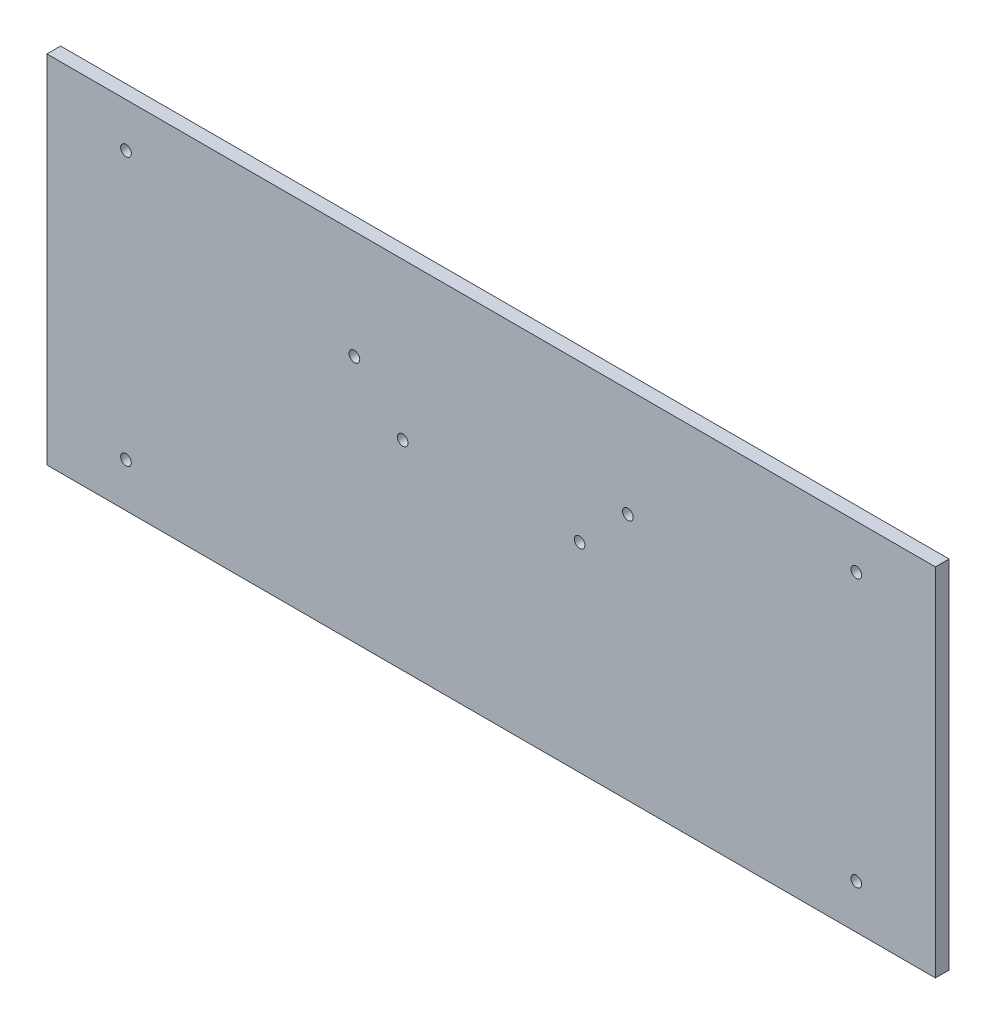
ISO-10303-21;
HEADER;
FILE_DESCRIPTION(('STEP AP214'),'2;1');
FILE_NAME('part.step','',(''),(''),'','','');
FILE_SCHEMA(('AUTOMOTIVE_DESIGN { 1 0 10303 214 1 1 1 1 }'));
ENDSEC;
DATA;
#1=APPLICATION_CONTEXT('core data for automotive mechanical design processes');
#2=APPLICATION_PROTOCOL_DEFINITION('international standard','automotive_design',2000,#1);
#3=PRODUCT_CONTEXT('',#1,'mechanical');
#4=PRODUCT('Part','Part','',(#3));
#5=PRODUCT_RELATED_PRODUCT_CATEGORY('part','',(#4));
#6=PRODUCT_DEFINITION_FORMATION('','',#4);
#7=PRODUCT_DEFINITION_CONTEXT('part definition',#1,'design');
#8=PRODUCT_DEFINITION('design','',#6,#7);
#9=PRODUCT_DEFINITION_SHAPE('','',#8);
#10=(LENGTH_UNIT() NAMED_UNIT(*) SI_UNIT(.MILLI.,.METRE.));
#11=(NAMED_UNIT(*) PLANE_ANGLE_UNIT() SI_UNIT($,.RADIAN.));
#12=(NAMED_UNIT(*) SI_UNIT($,.STERADIAN.) SOLID_ANGLE_UNIT());
#13=UNCERTAINTY_MEASURE_WITH_UNIT(LENGTH_MEASURE(1.E-05),#10,'distance_accuracy_value','');
#14=(GEOMETRIC_REPRESENTATION_CONTEXT(3) GLOBAL_UNCERTAINTY_ASSIGNED_CONTEXT((#13)) GLOBAL_UNIT_ASSIGNED_CONTEXT((#10,
#11,#12)) REPRESENTATION_CONTEXT('',''));
#15=CARTESIAN_POINT('',(0.,0.,0.));
#16=DIRECTION('',(0.,0.,1.));
#17=DIRECTION('',(1.,0.,0.));
#18=AXIS2_PLACEMENT_3D('',#15,#16,#17);
#19=CARTESIAN_POINT('',(-146.,0.,4.5));
#20=DIRECTION('',(-1.,0.,0.));
#21=DIRECTION('',(0.,0.,1.));
#22=AXIS2_PLACEMENT_3D('',#19,#20,#21);
#23=PLANE('',#22);
#24=DIRECTION('',(0.,1.,0.));
#25=VECTOR('',#24,1.);
#26=CARTESIAN_POINT('',(-146.,0.,0.));
#27=LINE('',#26,#25);
#28=CARTESIAN_POINT('',(-146.,-58.5,0.));
#29=VERTEX_POINT('',#28);
#30=CARTESIAN_POINT('',(-146.,58.5,0.));
#31=VERTEX_POINT('',#30);
#32=EDGE_CURVE('E108',#29,#31,#27,.T.);
#33=ORIENTED_EDGE('',*,*,#32,.F.);
#34=DIRECTION('',(0.,0.,-1.));
#35=VECTOR('',#34,1.);
#36=CARTESIAN_POINT('',(-146.,-58.5,4.5));
#37=LINE('',#36,#35);
#38=CARTESIAN_POINT('',(-146.,-58.5,4.5));
#39=VERTEX_POINT('',#38);
#40=EDGE_CURVE('E11',#39,#29,#37,.T.);
#41=ORIENTED_EDGE('',*,*,#40,.F.);
#42=DIRECTION('',(0.,1.,0.));
#43=VECTOR('',#42,1.);
#44=CARTESIAN_POINT('',(-146.,0.,4.5));
#45=LINE('',#44,#43);
#46=CARTESIAN_POINT('',(-146.,58.5,4.5));
#47=VERTEX_POINT('',#46);
#48=EDGE_CURVE('E98',#39,#47,#45,.T.);
#49=ORIENTED_EDGE('',*,*,#48,.T.);
#50=DIRECTION('',(0.,0.,-1.));
#51=VECTOR('',#50,1.);
#52=CARTESIAN_POINT('',(-146.,58.5,4.5));
#53=LINE('',#52,#51);
#54=EDGE_CURVE('E77',#47,#31,#53,.T.);
#55=ORIENTED_EDGE('',*,*,#54,.T.);
#56=EDGE_LOOP('',(#33,#41,#49,#55));
#57=FACE_BOUND('',#56,.T.);
#58=ADVANCED_FACE('F38',(#57),#23,.T.);
#59=CARTESIAN_POINT('',(0.,-58.5,4.5));
#60=DIRECTION('',(0.,-1.,0.));
#61=DIRECTION('',(1.,0.,0.));
#62=AXIS2_PLACEMENT_3D('',#59,#60,#61);
#63=PLANE('',#62);
#64=DIRECTION('',(-1.,0.,0.));
#65=VECTOR('',#64,1.);
#66=CARTESIAN_POINT('',(0.,-58.5,0.));
#67=LINE('',#66,#65);
#68=CARTESIAN_POINT('',(146.,-58.5,0.));
#69=VERTEX_POINT('',#68);
#70=EDGE_CURVE('E90',#69,#29,#67,.T.);
#71=ORIENTED_EDGE('',*,*,#70,.F.);
#72=DIRECTION('',(0.,0.,-1.));
#73=VECTOR('',#72,1.);
#74=CARTESIAN_POINT('',(146.,-58.5,4.5));
#75=LINE('',#74,#73);
#76=CARTESIAN_POINT('',(146.,-58.5,4.5));
#77=VERTEX_POINT('',#76);
#78=EDGE_CURVE('E47',#77,#69,#75,.T.);
#79=ORIENTED_EDGE('',*,*,#78,.F.);
#80=DIRECTION('',(-1.,0.,0.));
#81=VECTOR('',#80,1.);
#82=CARTESIAN_POINT('',(0.,-58.5,4.5));
#83=LINE('',#82,#81);
#84=EDGE_CURVE('E88',#77,#39,#83,.T.);
#85=ORIENTED_EDGE('',*,*,#84,.T.);
#86=ORIENTED_EDGE('',*,*,#40,.T.);
#87=EDGE_LOOP('',(#71,#79,#85,#86));
#88=FACE_BOUND('',#87,.T.);
#89=ADVANCED_FACE('F86',(#88),#63,.T.);
#90=CARTESIAN_POINT('',(146.,0.,4.5));
#91=DIRECTION('',(-1.,0.,0.));
#92=DIRECTION('',(0.,0.,1.));
#93=AXIS2_PLACEMENT_3D('',#90,#91,#92);
#94=PLANE('',#93);
#95=DIRECTION('',(0.,1.,0.));
#96=VECTOR('',#95,1.);
#97=CARTESIAN_POINT('',(146.,0.,0.));
#98=LINE('',#97,#96);
#99=CARTESIAN_POINT('',(146.,58.5,0.));
#100=VERTEX_POINT('',#99);
#101=EDGE_CURVE('E70',#69,#100,#98,.T.);
#102=ORIENTED_EDGE('',*,*,#101,.T.);
#103=DIRECTION('',(0.,0.,-1.));
#104=VECTOR('',#103,1.);
#105=CARTESIAN_POINT('',(146.,58.5,4.5));
#106=LINE('',#105,#104);
#107=CARTESIAN_POINT('',(146.,58.5,4.5));
#108=VERTEX_POINT('',#107);
#109=EDGE_CURVE('E92',#108,#100,#106,.T.);
#110=ORIENTED_EDGE('',*,*,#109,.F.);
#111=DIRECTION('',(0.,1.,0.));
#112=VECTOR('',#111,1.);
#113=CARTESIAN_POINT('',(146.,0.,4.5));
#114=LINE('',#113,#112);
#115=EDGE_CURVE('E93',#77,#108,#114,.T.);
#116=ORIENTED_EDGE('',*,*,#115,.F.);
#117=ORIENTED_EDGE('',*,*,#78,.T.);
#118=EDGE_LOOP('',(#102,#110,#116,#117));
#119=FACE_BOUND('',#118,.T.);
#120=ADVANCED_FACE('F94',(#119),#94,.F.);
#121=CARTESIAN_POINT('',(0.,58.5,4.5));
#122=DIRECTION('',(0.,-1.,0.));
#123=DIRECTION('',(1.,0.,0.));
#124=AXIS2_PLACEMENT_3D('',#121,#122,#123);
#125=PLANE('',#124);
#126=DIRECTION('',(-1.,0.,0.));
#127=VECTOR('',#126,1.);
#128=CARTESIAN_POINT('',(0.,58.5,0.));
#129=LINE('',#128,#127);
#130=EDGE_CURVE('E102',#100,#31,#129,.T.);
#131=ORIENTED_EDGE('',*,*,#130,.T.);
#132=ORIENTED_EDGE('',*,*,#54,.F.);
#133=DIRECTION('',(-1.,0.,0.));
#134=VECTOR('',#133,1.);
#135=CARTESIAN_POINT('',(0.,58.5,4.5));
#136=LINE('',#135,#134);
#137=EDGE_CURVE('E55',#108,#47,#136,.T.);
#138=ORIENTED_EDGE('',*,*,#137,.F.);
#139=ORIENTED_EDGE('',*,*,#109,.T.);
#140=EDGE_LOOP('',(#131,#132,#138,#139));
#141=FACE_BOUND('',#140,.T.);
#142=ADVANCED_FACE('F124',(#141),#125,.F.);
#143=CARTESIAN_POINT('',(0.,0.,4.5));
#144=DIRECTION('',(0.,0.,1.));
#145=DIRECTION('',(1.,0.,0.));
#146=AXIS2_PLACEMENT_3D('',#143,#144,#145);
#147=PLANE('',#146);
#148=CARTESIAN_POINT('',(29.0710678118655,7.07106781186543,4.5));
#149=DIRECTION('',(0.,0.,1.));
#150=DIRECTION('',(-1.,0.,0.));
#151=AXIS2_PLACEMENT_3D('',#148,#149,#150);
#152=CIRCLE('',#151,1.75);
#153=CARTESIAN_POINT('',(27.3210678118655,7.07106781186543,4.5));
#154=VERTEX_POINT('',#153);
#155=EDGE_CURVE('E204',#154,#154,#152,.T.);
#156=ORIENTED_EDGE('',*,*,#155,.F.);
#157=EDGE_LOOP('',(#156));
#158=FACE_BOUND('',#157,.T.);
#159=CARTESIAN_POINT('',(44.9289321881345,22.9289321881344,4.5));
#160=DIRECTION('',(0.,0.,1.));
#161=DIRECTION('',(-1.,0.,0.));
#162=AXIS2_PLACEMENT_3D('',#159,#160,#161);
#163=CIRCLE('',#162,1.75);
#164=CARTESIAN_POINT('',(43.1789321881345,22.9289321881344,4.5));
#165=VERTEX_POINT('',#164);
#166=EDGE_CURVE('E196',#165,#165,#163,.T.);
#167=ORIENTED_EDGE('',*,*,#166,.F.);
#168=EDGE_LOOP('',(#167));
#169=FACE_BOUND('',#168,.T.);
#170=CARTESIAN_POINT('',(-44.9289321881344,22.9289321881345,4.5));
#171=DIRECTION('',(0.,0.,1.));
#172=DIRECTION('',(1.,0.,0.));
#173=AXIS2_PLACEMENT_3D('',#170,#171,#172);
#174=CIRCLE('',#173,1.75);
#175=CARTESIAN_POINT('',(-43.1789321881344,22.9289321881345,4.5));
#176=VERTEX_POINT('',#175);
#177=EDGE_CURVE('E180',#176,#176,#174,.T.);
#178=ORIENTED_EDGE('',*,*,#177,.F.);
#179=EDGE_LOOP('',(#178));
#180=FACE_BOUND('',#179,.T.);
#181=CARTESIAN_POINT('',(-29.0710678118655,7.07106781186548,4.5));
#182=DIRECTION('',(0.,0.,1.));
#183=DIRECTION('',(1.,0.,0.));
#184=AXIS2_PLACEMENT_3D('',#181,#182,#183);
#185=CIRCLE('',#184,1.75);
#186=CARTESIAN_POINT('',(-27.3210678118655,7.07106781186548,4.5));
#187=VERTEX_POINT('',#186);
#188=EDGE_CURVE('E186',#187,#187,#185,.T.);
#189=ORIENTED_EDGE('',*,*,#188,.F.);
#190=EDGE_LOOP('',(#189));
#191=FACE_BOUND('',#190,.T.);
#192=CARTESIAN_POINT('',(120.,44.,4.5));
#193=DIRECTION('',(0.,0.,1.));
#194=DIRECTION('',(1.,0.,0.));
#195=AXIS2_PLACEMENT_3D('',#192,#193,#194);
#196=CIRCLE('',#195,1.75);
#197=CARTESIAN_POINT('',(121.75,44.,4.5));
#198=VERTEX_POINT('',#197);
#199=EDGE_CURVE('E214',#198,#198,#196,.F.);
#200=ORIENTED_EDGE('',*,*,#199,.T.);
#201=EDGE_LOOP('',(#200));
#202=FACE_BOUND('',#201,.T.);
#203=CARTESIAN_POINT('',(120.,-44.,4.5));
#204=DIRECTION('',(0.,0.,1.));
#205=DIRECTION('',(1.,0.,0.));
#206=AXIS2_PLACEMENT_3D('',#203,#204,#205);
#207=CIRCLE('',#206,1.75);
#208=CARTESIAN_POINT('',(121.75,-44.,4.5));
#209=VERTEX_POINT('',#208);
#210=EDGE_CURVE('E226',#209,#209,#207,.T.);
#211=ORIENTED_EDGE('',*,*,#210,.F.);
#212=EDGE_LOOP('',(#211));
#213=FACE_BOUND('',#212,.T.);
#214=CARTESIAN_POINT('',(-120.,-44.,4.5));
#215=DIRECTION('',(0.,0.,1.));
#216=DIRECTION('',(1.,0.,0.));
#217=AXIS2_PLACEMENT_3D('',#214,#215,#216);
#218=CIRCLE('',#217,1.75);
#219=CARTESIAN_POINT('',(-118.25,-44.,4.5));
#220=VERTEX_POINT('',#219);
#221=EDGE_CURVE('E230',#220,#220,#218,.F.);
#222=ORIENTED_EDGE('',*,*,#221,.T.);
#223=EDGE_LOOP('',(#222));
#224=FACE_BOUND('',#223,.T.);
#225=CARTESIAN_POINT('',(-120.,44.,4.5));
#226=DIRECTION('',(0.,0.,1.));
#227=DIRECTION('',(1.,0.,0.));
#228=AXIS2_PLACEMENT_3D('',#225,#226,#227);
#229=CIRCLE('',#228,1.75);
#230=CARTESIAN_POINT('',(-118.25,44.,4.5));
#231=VERTEX_POINT('',#230);
#232=EDGE_CURVE('E112',#231,#231,#229,.T.);
#233=ORIENTED_EDGE('',*,*,#232,.F.);
#234=EDGE_LOOP('',(#233));
#235=FACE_BOUND('',#234,.T.);
#236=ORIENTED_EDGE('',*,*,#48,.F.);
#237=ORIENTED_EDGE('',*,*,#84,.F.);
#238=ORIENTED_EDGE('',*,*,#115,.T.);
#239=ORIENTED_EDGE('',*,*,#137,.T.);
#240=EDGE_LOOP('',(#236,#237,#238,#239));
#241=FACE_BOUND('',#240,.T.);
#242=ADVANCED_FACE('F97',(#158,#169,#180,#191,#202,#213,#224,#235,#241),#147,.T.);
#243=CARTESIAN_POINT('',(0.,0.,0.));
#244=DIRECTION('',(0.,0.,1.));
#245=DIRECTION('',(1.,0.,0.));
#246=AXIS2_PLACEMENT_3D('',#243,#244,#245);
#247=PLANE('',#246);
#248=CARTESIAN_POINT('',(29.0710678118655,7.07106781186543,0.));
#249=DIRECTION('',(0.,0.,1.));
#250=DIRECTION('',(1.,0.,0.));
#251=AXIS2_PLACEMENT_3D('',#248,#249,#250);
#252=CIRCLE('',#251,1.75);
#253=CARTESIAN_POINT('',(30.8210678118655,7.07106781186543,0.));
#254=VERTEX_POINT('',#253);
#255=EDGE_CURVE('E200',#254,#254,#252,.F.);
#256=ORIENTED_EDGE('',*,*,#255,.F.);
#257=EDGE_LOOP('',(#256));
#258=FACE_BOUND('',#257,.T.);
#259=CARTESIAN_POINT('',(44.9289321881345,22.9289321881344,0.));
#260=DIRECTION('',(0.,0.,1.));
#261=DIRECTION('',(1.,0.,0.));
#262=AXIS2_PLACEMENT_3D('',#259,#260,#261);
#263=CIRCLE('',#262,1.75);
#264=CARTESIAN_POINT('',(46.6789321881345,22.9289321881344,0.));
#265=VERTEX_POINT('',#264);
#266=EDGE_CURVE('E193',#265,#265,#263,.F.);
#267=ORIENTED_EDGE('',*,*,#266,.F.);
#268=EDGE_LOOP('',(#267));
#269=FACE_BOUND('',#268,.T.);
#270=CARTESIAN_POINT('',(-44.9289321881344,22.9289321881345,0.));
#271=DIRECTION('',(0.,0.,1.));
#272=DIRECTION('',(1.,0.,0.));
#273=AXIS2_PLACEMENT_3D('',#270,#271,#272);
#274=CIRCLE('',#273,1.75);
#275=CARTESIAN_POINT('',(-43.1789321881344,22.9289321881345,0.));
#276=VERTEX_POINT('',#275);
#277=EDGE_CURVE('E183',#276,#276,#274,.F.);
#278=ORIENTED_EDGE('',*,*,#277,.F.);
#279=EDGE_LOOP('',(#278));
#280=FACE_BOUND('',#279,.T.);
#281=CARTESIAN_POINT('',(-29.0710678118655,7.07106781186548,0.));
#282=DIRECTION('',(0.,0.,1.));
#283=DIRECTION('',(1.,0.,0.));
#284=AXIS2_PLACEMENT_3D('',#281,#282,#283);
#285=CIRCLE('',#284,1.75);
#286=CARTESIAN_POINT('',(-27.3210678118655,7.07106781186548,0.));
#287=VERTEX_POINT('',#286);
#288=EDGE_CURVE('E191',#287,#287,#285,.F.);
#289=ORIENTED_EDGE('',*,*,#288,.F.);
#290=EDGE_LOOP('',(#289));
#291=FACE_BOUND('',#290,.T.);
#292=CARTESIAN_POINT('',(120.,44.,0.));
#293=DIRECTION('',(0.,0.,-1.));
#294=DIRECTION('',(-1.,0.,0.));
#295=AXIS2_PLACEMENT_3D('',#292,#293,#294);
#296=CIRCLE('',#295,1.75);
#297=CARTESIAN_POINT('',(118.25,44.,0.));
#298=VERTEX_POINT('',#297);
#299=EDGE_CURVE('E215',#298,#298,#296,.T.);
#300=ORIENTED_EDGE('',*,*,#299,.F.);
#301=EDGE_LOOP('',(#300));
#302=FACE_BOUND('',#301,.T.);
#303=CARTESIAN_POINT('',(120.,-44.,0.));
#304=DIRECTION('',(0.,0.,1.));
#305=DIRECTION('',(-1.,0.,0.));
#306=AXIS2_PLACEMENT_3D('',#303,#304,#305);
#307=CIRCLE('',#306,1.75);
#308=CARTESIAN_POINT('',(118.25,-44.,0.));
#309=VERTEX_POINT('',#308);
#310=EDGE_CURVE('E219',#309,#309,#307,.T.);
#311=ORIENTED_EDGE('',*,*,#310,.T.);
#312=EDGE_LOOP('',(#311));
#313=FACE_BOUND('',#312,.T.);
#314=CARTESIAN_POINT('',(-120.,-44.,0.));
#315=DIRECTION('',(0.,0.,-1.));
#316=DIRECTION('',(1.,0.,0.));
#317=AXIS2_PLACEMENT_3D('',#314,#315,#316);
#318=CIRCLE('',#317,1.75);
#319=CARTESIAN_POINT('',(-118.25,-44.,0.));
#320=VERTEX_POINT('',#319);
#321=EDGE_CURVE('E231',#320,#320,#318,.T.);
#322=ORIENTED_EDGE('',*,*,#321,.F.);
#323=EDGE_LOOP('',(#322));
#324=FACE_BOUND('',#323,.T.);
#325=CARTESIAN_POINT('',(-120.,44.,0.));
#326=DIRECTION('',(0.,0.,1.));
#327=DIRECTION('',(1.,0.,0.));
#328=AXIS2_PLACEMENT_3D('',#325,#326,#327);
#329=CIRCLE('',#328,1.75);
#330=CARTESIAN_POINT('',(-118.25,44.,0.));
#331=VERTEX_POINT('',#330);
#332=EDGE_CURVE('E235',#331,#331,#329,.T.);
#333=ORIENTED_EDGE('',*,*,#332,.T.);
#334=EDGE_LOOP('',(#333));
#335=FACE_BOUND('',#334,.T.);
#336=ORIENTED_EDGE('',*,*,#32,.T.);
#337=ORIENTED_EDGE('',*,*,#130,.F.);
#338=ORIENTED_EDGE('',*,*,#101,.F.);
#339=ORIENTED_EDGE('',*,*,#70,.T.);
#340=EDGE_LOOP('',(#336,#337,#338,#339));
#341=FACE_BOUND('',#340,.T.);
#342=ADVANCED_FACE('F126',(#258,#269,#280,#291,#302,#313,#324,#335,#341),#247,.F.);
#343=CARTESIAN_POINT('',(-120.,44.,4.501));
#344=DIRECTION('',(0.,0.,-1.));
#345=DIRECTION('',(-1.,0.,0.));
#346=AXIS2_PLACEMENT_3D('',#343,#344,#345);
#347=CYLINDRICAL_SURFACE('',#346,1.75);
#348=ORIENTED_EDGE('',*,*,#232,.T.);
#349=EDGE_LOOP('',(#348));
#350=FACE_BOUND('',#349,.T.);
#351=ORIENTED_EDGE('',*,*,#332,.F.);
#352=EDGE_LOOP('',(#351));
#353=FACE_BOUND('',#352,.T.);
#354=ADVANCED_FACE('F140',(#350,#353),#347,.F.);
#355=CARTESIAN_POINT('',(-120.,-44.,4.501));
#356=DIRECTION('',(0.,0.,-1.));
#357=DIRECTION('',(-1.,0.,0.));
#358=AXIS2_PLACEMENT_3D('',#355,#356,#357);
#359=CYLINDRICAL_SURFACE('',#358,1.75);
#360=ORIENTED_EDGE('',*,*,#221,.F.);
#361=EDGE_LOOP('',(#360));
#362=FACE_BOUND('',#361,.T.);
#363=ORIENTED_EDGE('',*,*,#321,.T.);
#364=EDGE_LOOP('',(#363));
#365=FACE_BOUND('',#364,.T.);
#366=ADVANCED_FACE('F147',(#362,#365),#359,.F.);
#367=CARTESIAN_POINT('',(120.,-44.,4.501));
#368=DIRECTION('',(0.,0.,-1.));
#369=DIRECTION('',(-1.,0.,0.));
#370=AXIS2_PLACEMENT_3D('',#367,#368,#369);
#371=CYLINDRICAL_SURFACE('',#370,1.75);
#372=ORIENTED_EDGE('',*,*,#210,.T.);
#373=EDGE_LOOP('',(#372));
#374=FACE_BOUND('',#373,.T.);
#375=ORIENTED_EDGE('',*,*,#310,.F.);
#376=EDGE_LOOP('',(#375));
#377=FACE_BOUND('',#376,.T.);
#378=ADVANCED_FACE('F151',(#374,#377),#371,.F.);
#379=CARTESIAN_POINT('',(120.,44.,4.501));
#380=DIRECTION('',(0.,0.,-1.));
#381=DIRECTION('',(-1.,0.,0.));
#382=AXIS2_PLACEMENT_3D('',#379,#380,#381);
#383=CYLINDRICAL_SURFACE('',#382,1.75);
#384=ORIENTED_EDGE('',*,*,#199,.F.);
#385=EDGE_LOOP('',(#384));
#386=FACE_BOUND('',#385,.T.);
#387=ORIENTED_EDGE('',*,*,#299,.T.);
#388=EDGE_LOOP('',(#387));
#389=FACE_BOUND('',#388,.T.);
#390=ADVANCED_FACE('F155',(#386,#389),#383,.F.);
#391=CARTESIAN_POINT('',(-29.0710678118655,7.07106781186548,-0.00100000000000013));
#392=DIRECTION('',(0.,0.,1.));
#393=DIRECTION('',(1.,0.,0.));
#394=AXIS2_PLACEMENT_3D('',#391,#392,#393);
#395=CYLINDRICAL_SURFACE('',#394,1.75);
#396=ORIENTED_EDGE('',*,*,#188,.T.);
#397=EDGE_LOOP('',(#396));
#398=FACE_BOUND('',#397,.T.);
#399=ORIENTED_EDGE('',*,*,#288,.T.);
#400=EDGE_LOOP('',(#399));
#401=FACE_BOUND('',#400,.T.);
#402=ADVANCED_FACE('F159',(#398,#401),#395,.F.);
#403=CARTESIAN_POINT('',(-44.9289321881344,22.9289321881345,-0.00100000000000013));
#404=DIRECTION('',(0.,0.,1.));
#405=DIRECTION('',(1.,0.,0.));
#406=AXIS2_PLACEMENT_3D('',#403,#404,#405);
#407=CYLINDRICAL_SURFACE('',#406,1.75);
#408=ORIENTED_EDGE('',*,*,#177,.T.);
#409=EDGE_LOOP('',(#408));
#410=FACE_BOUND('',#409,.T.);
#411=ORIENTED_EDGE('',*,*,#277,.T.);
#412=EDGE_LOOP('',(#411));
#413=FACE_BOUND('',#412,.T.);
#414=ADVANCED_FACE('F163',(#410,#413),#407,.F.);
#415=CARTESIAN_POINT('',(44.9289321881345,22.9289321881344,-0.00100000000000013));
#416=DIRECTION('',(0.,0.,1.));
#417=DIRECTION('',(1.,0.,0.));
#418=AXIS2_PLACEMENT_3D('',#415,#416,#417);
#419=CYLINDRICAL_SURFACE('',#418,1.75);
#420=ORIENTED_EDGE('',*,*,#166,.T.);
#421=EDGE_LOOP('',(#420));
#422=FACE_BOUND('',#421,.T.);
#423=ORIENTED_EDGE('',*,*,#266,.T.);
#424=EDGE_LOOP('',(#423));
#425=FACE_BOUND('',#424,.T.);
#426=ADVANCED_FACE('F168',(#422,#425),#419,.F.);
#427=CARTESIAN_POINT('',(29.0710678118655,7.07106781186543,-0.00100000000000013));
#428=DIRECTION('',(0.,0.,1.));
#429=DIRECTION('',(1.,0.,0.));
#430=AXIS2_PLACEMENT_3D('',#427,#428,#429);
#431=CYLINDRICAL_SURFACE('',#430,1.75);
#432=ORIENTED_EDGE('',*,*,#155,.T.);
#433=EDGE_LOOP('',(#432));
#434=FACE_BOUND('',#433,.T.);
#435=ORIENTED_EDGE('',*,*,#255,.T.);
#436=EDGE_LOOP('',(#435));
#437=FACE_BOUND('',#436,.T.);
#438=ADVANCED_FACE('F165',(#434,#437),#431,.F.);
#439=CLOSED_SHELL('',(#58,#89,#120,#142,#242,#342,#354,#366,#378,#390,#402,#414,#426,#438));
#440=MANIFOLD_SOLID_BREP('B2',#439);
#441=ADVANCED_BREP_SHAPE_REPRESENTATION('',(#18,#440),#14);
#442=SHAPE_DEFINITION_REPRESENTATION(#9,#441);
ENDSEC;
END-ISO-10303-21;
